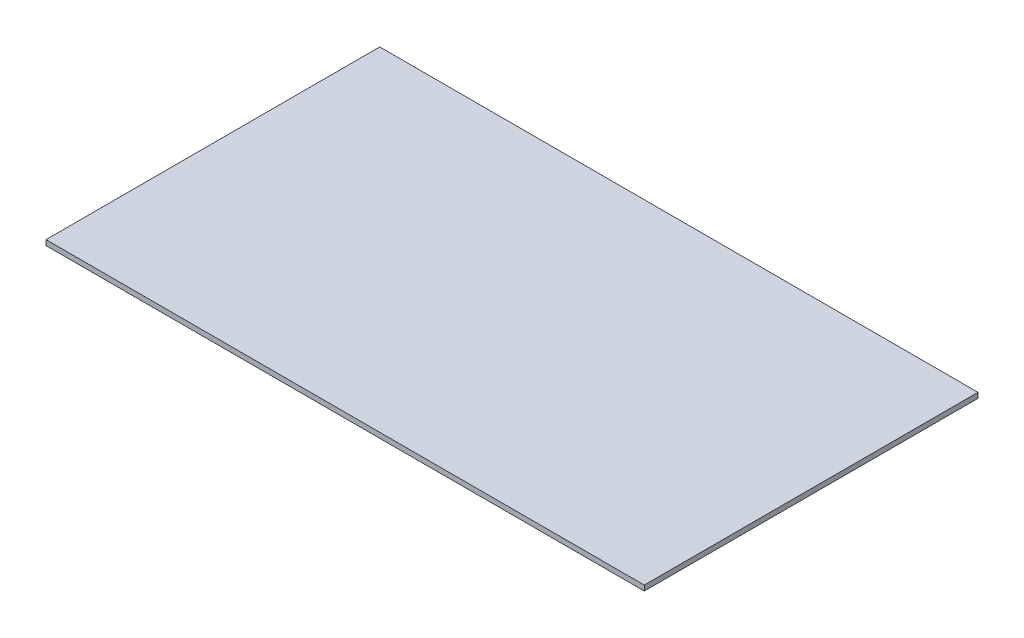
ISO-10303-21;
HEADER;
FILE_DESCRIPTION(('STEP AP214'),'2;1');
FILE_NAME('part.step','',(''),(''),'','','');
FILE_SCHEMA(('AUTOMOTIVE_DESIGN { 1 0 10303 214 1 1 1 1 }'));
ENDSEC;
DATA;
#1=APPLICATION_CONTEXT('core data for automotive mechanical design processes');
#2=APPLICATION_PROTOCOL_DEFINITION('international standard','automotive_design',2000,#1);
#3=PRODUCT_CONTEXT('',#1,'mechanical');
#4=PRODUCT('Part','Part','',(#3));
#5=PRODUCT_RELATED_PRODUCT_CATEGORY('part','',(#4));
#6=PRODUCT_DEFINITION_FORMATION('','',#4);
#7=PRODUCT_DEFINITION_CONTEXT('part definition',#1,'design');
#8=PRODUCT_DEFINITION('design','',#6,#7);
#9=PRODUCT_DEFINITION_SHAPE('','',#8);
#10=(LENGTH_UNIT() NAMED_UNIT(*) SI_UNIT(.MILLI.,.METRE.));
#11=(NAMED_UNIT(*) PLANE_ANGLE_UNIT() SI_UNIT($,.RADIAN.));
#12=(NAMED_UNIT(*) SI_UNIT($,.STERADIAN.) SOLID_ANGLE_UNIT());
#13=UNCERTAINTY_MEASURE_WITH_UNIT(LENGTH_MEASURE(1.E-05),#10,'distance_accuracy_value','');
#14=(GEOMETRIC_REPRESENTATION_CONTEXT(3) GLOBAL_UNCERTAINTY_ASSIGNED_CONTEXT((#13)) GLOBAL_UNIT_ASSIGNED_CONTEXT((#10,
#11,#12)) REPRESENTATION_CONTEXT('',''));
#15=CARTESIAN_POINT('',(0.,0.,0.));
#16=DIRECTION('',(0.,0.,1.));
#17=DIRECTION('',(1.,0.,0.));
#18=AXIS2_PLACEMENT_3D('',#15,#16,#17);
#19=CARTESIAN_POINT('',(1092.87,19.05,-609.6));
#20=DIRECTION('',(-1.,0.,0.));
#21=DIRECTION('',(0.,0.,1.));
#22=AXIS2_PLACEMENT_3D('',#19,#20,#21);
#23=PLANE('',#22);
#24=DIRECTION('',(0.,0.,-1.));
#25=VECTOR('',#24,1.);
#26=CARTESIAN_POINT('',(1092.87,0.,-609.6));
#27=LINE('',#26,#25);
#28=CARTESIAN_POINT('',(1092.87,0.,609.6));
#29=VERTEX_POINT('',#28);
#30=CARTESIAN_POINT('',(1092.87,0.,-609.6));
#31=VERTEX_POINT('',#30);
#32=EDGE_CURVE('E96',#29,#31,#27,.T.);
#33=ORIENTED_EDGE('',*,*,#32,.T.);
#34=DIRECTION('',(0.,-1.,0.));
#35=VECTOR('',#34,1.);
#36=CARTESIAN_POINT('',(1092.87,19.05,-609.6));
#37=LINE('',#36,#35);
#38=CARTESIAN_POINT('',(1092.87,19.05,-609.6));
#39=VERTEX_POINT('',#38);
#40=EDGE_CURVE('E11',#39,#31,#37,.T.);
#41=ORIENTED_EDGE('',*,*,#40,.F.);
#42=DIRECTION('',(0.,0.,-1.));
#43=VECTOR('',#42,1.);
#44=CARTESIAN_POINT('',(1092.87,19.05,-609.6));
#45=LINE('',#44,#43);
#46=CARTESIAN_POINT('',(1092.87,19.05,609.6));
#47=VERTEX_POINT('',#46);
#48=EDGE_CURVE('E84',#47,#39,#45,.T.);
#49=ORIENTED_EDGE('',*,*,#48,.F.);
#50=DIRECTION('',(0.,-1.,0.));
#51=VECTOR('',#50,1.);
#52=CARTESIAN_POINT('',(1092.87,19.05,609.6));
#53=LINE('',#52,#51);
#54=EDGE_CURVE('E92',#47,#29,#53,.T.);
#55=ORIENTED_EDGE('',*,*,#54,.T.);
#56=EDGE_LOOP('',(#33,#41,#49,#55));
#57=FACE_BOUND('',#56,.T.);
#58=ADVANCED_FACE('F33',(#57),#23,.F.);
#59=CARTESIAN_POINT('',(-1092.87,19.05,-609.6));
#60=DIRECTION('',(0.,0.,1.));
#61=DIRECTION('',(1.,0.,0.));
#62=AXIS2_PLACEMENT_3D('',#59,#60,#61);
#63=PLANE('',#62);
#64=DIRECTION('',(-1.,0.,0.));
#65=VECTOR('',#64,1.);
#66=CARTESIAN_POINT('',(-1092.87,0.,-609.6));
#67=LINE('',#66,#65);
#68=CARTESIAN_POINT('',(-1092.87,0.,-609.6));
#69=VERTEX_POINT('',#68);
#70=EDGE_CURVE('E88',#31,#69,#67,.T.);
#71=ORIENTED_EDGE('',*,*,#70,.T.);
#72=DIRECTION('',(0.,-1.,0.));
#73=VECTOR('',#72,1.);
#74=CARTESIAN_POINT('',(-1092.87,19.05,-609.6));
#75=LINE('',#74,#73);
#76=CARTESIAN_POINT('',(-1092.87,19.05,-609.6));
#77=VERTEX_POINT('',#76);
#78=EDGE_CURVE('E41',#77,#69,#75,.T.);
#79=ORIENTED_EDGE('',*,*,#78,.F.);
#80=DIRECTION('',(-1.,0.,0.));
#81=VECTOR('',#80,1.);
#82=CARTESIAN_POINT('',(-1092.87,19.05,-609.6));
#83=LINE('',#82,#81);
#84=EDGE_CURVE('E79',#39,#77,#83,.T.);
#85=ORIENTED_EDGE('',*,*,#84,.F.);
#86=ORIENTED_EDGE('',*,*,#40,.T.);
#87=EDGE_LOOP('',(#71,#79,#85,#86));
#88=FACE_BOUND('',#87,.T.);
#89=ADVANCED_FACE('F87',(#88),#63,.F.);
#90=CARTESIAN_POINT('',(-1092.87,19.05,-609.6));
#91=DIRECTION('',(1.,0.,0.));
#92=DIRECTION('',(0.,0.,-1.));
#93=AXIS2_PLACEMENT_3D('',#90,#91,#92);
#94=PLANE('',#93);
#95=DIRECTION('',(0.,0.,1.));
#96=VECTOR('',#95,1.);
#97=CARTESIAN_POINT('',(-1092.87,0.,-609.6));
#98=LINE('',#97,#96);
#99=CARTESIAN_POINT('',(-1092.87,0.,609.6));
#100=VERTEX_POINT('',#99);
#101=EDGE_CURVE('E66',#69,#100,#98,.T.);
#102=ORIENTED_EDGE('',*,*,#101,.T.);
#103=DIRECTION('',(0.,-1.,0.));
#104=VECTOR('',#103,1.);
#105=CARTESIAN_POINT('',(-1092.87,19.05,609.6));
#106=LINE('',#105,#104);
#107=CARTESIAN_POINT('',(-1092.87,19.05,609.6));
#108=VERTEX_POINT('',#107);
#109=EDGE_CURVE('E89',#108,#100,#106,.T.);
#110=ORIENTED_EDGE('',*,*,#109,.F.);
#111=DIRECTION('',(0.,0.,1.));
#112=VECTOR('',#111,1.);
#113=CARTESIAN_POINT('',(-1092.87,19.05,-609.6));
#114=LINE('',#113,#112);
#115=EDGE_CURVE('E82',#77,#108,#114,.T.);
#116=ORIENTED_EDGE('',*,*,#115,.F.);
#117=ORIENTED_EDGE('',*,*,#78,.T.);
#118=EDGE_LOOP('',(#102,#110,#116,#117));
#119=FACE_BOUND('',#118,.T.);
#120=ADVANCED_FACE('F90',(#119),#94,.F.);
#121=CARTESIAN_POINT('',(-1092.87,19.05,609.6));
#122=DIRECTION('',(0.,0.,-1.));
#123=DIRECTION('',(-1.,0.,0.));
#124=AXIS2_PLACEMENT_3D('',#121,#122,#123);
#125=PLANE('',#124);
#126=DIRECTION('',(1.,0.,0.));
#127=VECTOR('',#126,1.);
#128=CARTESIAN_POINT('',(-1092.87,0.,609.6));
#129=LINE('',#128,#127);
#130=EDGE_CURVE('E72',#100,#29,#129,.T.);
#131=ORIENTED_EDGE('',*,*,#130,.T.);
#132=ORIENTED_EDGE('',*,*,#54,.F.);
#133=DIRECTION('',(1.,0.,0.));
#134=VECTOR('',#133,1.);
#135=CARTESIAN_POINT('',(-1092.87,19.05,609.6));
#136=LINE('',#135,#134);
#137=EDGE_CURVE('E49',#108,#47,#136,.T.);
#138=ORIENTED_EDGE('',*,*,#137,.F.);
#139=ORIENTED_EDGE('',*,*,#109,.T.);
#140=EDGE_LOOP('',(#131,#132,#138,#139));
#141=FACE_BOUND('',#140,.T.);
#142=ADVANCED_FACE('F103',(#141),#125,.F.);
#143=CARTESIAN_POINT('',(0.,19.05,0.));
#144=DIRECTION('',(0.,1.,0.));
#145=DIRECTION('',(0.,0.,1.));
#146=AXIS2_PLACEMENT_3D('',#143,#144,#145);
#147=PLANE('',#146);
#148=ORIENTED_EDGE('',*,*,#48,.T.);
#149=ORIENTED_EDGE('',*,*,#84,.T.);
#150=ORIENTED_EDGE('',*,*,#115,.T.);
#151=ORIENTED_EDGE('',*,*,#137,.T.);
#152=EDGE_LOOP('',(#148,#149,#150,#151));
#153=FACE_BOUND('',#152,.T.);
#154=ADVANCED_FACE('F80',(#153),#147,.T.);
#155=CARTESIAN_POINT('',(0.,0.,0.));
#156=DIRECTION('',(0.,1.,0.));
#157=DIRECTION('',(0.,0.,1.));
#158=AXIS2_PLACEMENT_3D('',#155,#156,#157);
#159=PLANE('',#158);
#160=ORIENTED_EDGE('',*,*,#32,.F.);
#161=ORIENTED_EDGE('',*,*,#130,.F.);
#162=ORIENTED_EDGE('',*,*,#101,.F.);
#163=ORIENTED_EDGE('',*,*,#70,.F.);
#164=EDGE_LOOP('',(#160,#161,#162,#163));
#165=FACE_BOUND('',#164,.T.);
#166=ADVANCED_FACE('F106',(#165),#159,.F.);
#167=CLOSED_SHELL('',(#58,#89,#120,#142,#154,#166));
#168=MANIFOLD_SOLID_BREP('B2',#167);
#169=ADVANCED_BREP_SHAPE_REPRESENTATION('',(#18,#168),#14);
#170=SHAPE_DEFINITION_REPRESENTATION(#9,#169);
ENDSEC;
END-ISO-10303-21;
